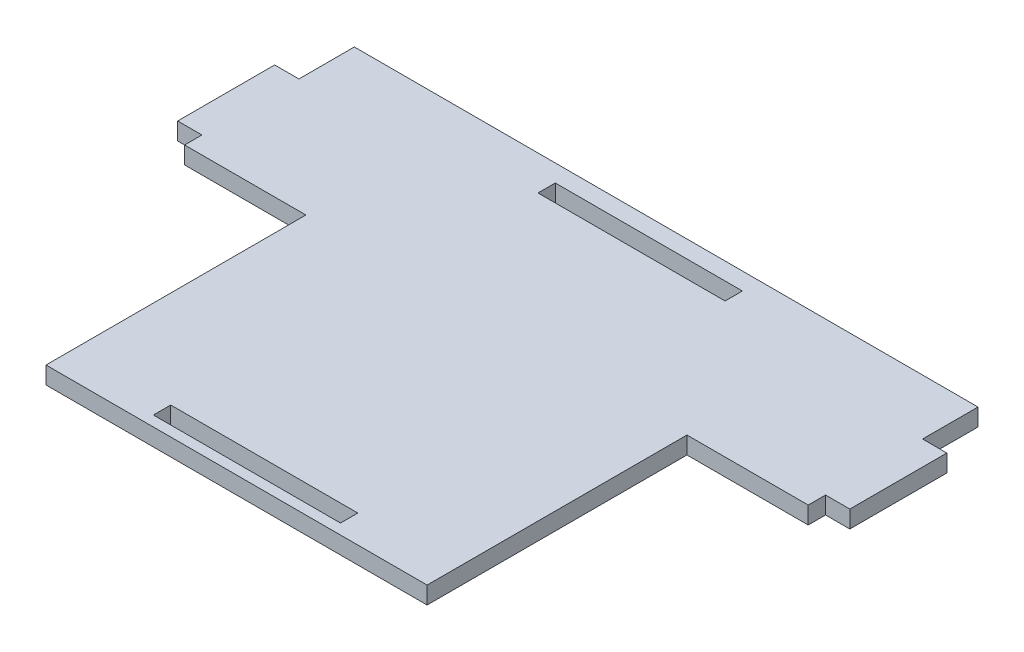
ISO-10303-21;
HEADER;
FILE_DESCRIPTION(('STEP AP214'),'2;1');
FILE_NAME('part.step','',(''),(''),'','','');
FILE_SCHEMA(('AUTOMOTIVE_DESIGN { 1 0 10303 214 1 1 1 1 }'));
ENDSEC;
DATA;
#1=APPLICATION_CONTEXT('core data for automotive mechanical design processes');
#2=APPLICATION_PROTOCOL_DEFINITION('international standard','automotive_design',2000,#1);
#3=PRODUCT_CONTEXT('',#1,'mechanical');
#4=PRODUCT('Part','Part','',(#3));
#5=PRODUCT_RELATED_PRODUCT_CATEGORY('part','',(#4));
#6=PRODUCT_DEFINITION_FORMATION('','',#4);
#7=PRODUCT_DEFINITION_CONTEXT('part definition',#1,'design');
#8=PRODUCT_DEFINITION('design','',#6,#7);
#9=PRODUCT_DEFINITION_SHAPE('','',#8);
#10=(LENGTH_UNIT() NAMED_UNIT(*) SI_UNIT(.MILLI.,.METRE.));
#11=(NAMED_UNIT(*) PLANE_ANGLE_UNIT() SI_UNIT($,.RADIAN.));
#12=(NAMED_UNIT(*) SI_UNIT($,.STERADIAN.) SOLID_ANGLE_UNIT());
#13=UNCERTAINTY_MEASURE_WITH_UNIT(LENGTH_MEASURE(1.E-05),#10,'distance_accuracy_value','');
#14=(GEOMETRIC_REPRESENTATION_CONTEXT(3) GLOBAL_UNCERTAINTY_ASSIGNED_CONTEXT((#13)) GLOBAL_UNIT_ASSIGNED_CONTEXT((#10,
#11,#12)) REPRESENTATION_CONTEXT('',''));
#15=CARTESIAN_POINT('',(0.,0.,0.));
#16=DIRECTION('',(0.,0.,1.));
#17=DIRECTION('',(1.,0.,0.));
#18=AXIS2_PLACEMENT_3D('',#15,#16,#17);
#19=CARTESIAN_POINT('',(0.,5.,0.));
#20=DIRECTION('',(0.,-1.,0.));
#21=DIRECTION('',(0.,0.,-1.));
#22=AXIS2_PLACEMENT_3D('',#19,#20,#21);
#23=PLANE('',#22);
#24=DIRECTION('',(-1.,0.,0.));
#25=VECTOR('',#24,1.);
#26=CARTESIAN_POINT('',(-27.,5.,53.));
#27=LINE('',#26,#25);
#28=CARTESIAN_POINT('',(27.,5.,53.));
#29=VERTEX_POINT('',#28);
#30=CARTESIAN_POINT('',(-27.,5.,53.));
#31=VERTEX_POINT('',#30);
#32=EDGE_CURVE('E249',#29,#31,#27,.T.);
#33=ORIENTED_EDGE('',*,*,#32,.F.);
#34=DIRECTION('',(0.,0.,-1.));
#35=VECTOR('',#34,1.);
#36=CARTESIAN_POINT('',(27.,5.,58.));
#37=LINE('',#36,#35);
#38=CARTESIAN_POINT('',(27.,5.,58.));
#39=VERTEX_POINT('',#38);
#40=EDGE_CURVE('E260',#39,#29,#37,.T.);
#41=ORIENTED_EDGE('',*,*,#40,.F.);
#42=DIRECTION('',(1.,0.,0.));
#43=VECTOR('',#42,1.);
#44=CARTESIAN_POINT('',(-27.,5.,58.));
#45=LINE('',#44,#43);
#46=CARTESIAN_POINT('',(-27.,5.,58.));
#47=VERTEX_POINT('',#46);
#48=EDGE_CURVE('E256',#47,#39,#45,.T.);
#49=ORIENTED_EDGE('',*,*,#48,.F.);
#50=DIRECTION('',(0.,0.,1.));
#51=VECTOR('',#50,1.);
#52=CARTESIAN_POINT('',(-27.,5.,58.));
#53=LINE('',#52,#51);
#54=EDGE_CURVE('E252',#31,#47,#53,.T.);
#55=ORIENTED_EDGE('',*,*,#54,.F.);
#56=EDGE_LOOP('',(#33,#41,#49,#55));
#57=FACE_BOUND('',#56,.T.);
#58=DIRECTION('',(0.,0.,-1.));
#59=VECTOR('',#58,1.);
#60=CARTESIAN_POINT('',(90.,5.,-47.));
#61=LINE('',#60,#59);
#62=CARTESIAN_POINT('',(90.,5.,-47.));
#63=VERTEX_POINT('',#62);
#64=CARTESIAN_POINT('',(90.,5.,-63.));
#65=VERTEX_POINT('',#64);
#66=EDGE_CURVE('E292',#63,#65,#61,.T.);
#67=ORIENTED_EDGE('',*,*,#66,.T.);
#68=DIRECTION('',(-1.,0.,0.));
#69=VECTOR('',#68,1.);
#70=CARTESIAN_POINT('',(-90.,5.,-63.));
#71=LINE('',#70,#69);
#72=CARTESIAN_POINT('',(-90.,5.,-63.));
#73=VERTEX_POINT('',#72);
#74=EDGE_CURVE('E296',#65,#73,#71,.T.);
#75=ORIENTED_EDGE('',*,*,#74,.T.);
#76=DIRECTION('',(0.,0.,1.));
#77=VECTOR('',#76,1.);
#78=CARTESIAN_POINT('',(-90.0000000000001,5.,-47.));
#79=LINE('',#78,#77);
#80=CARTESIAN_POINT('',(-90.0000000000001,5.,-47.));
#81=VERTEX_POINT('',#80);
#82=EDGE_CURVE('E300',#73,#81,#79,.T.);
#83=ORIENTED_EDGE('',*,*,#82,.T.);
#84=DIRECTION('',(-1.,0.,0.));
#85=VECTOR('',#84,1.);
#86=CARTESIAN_POINT('',(-90.0000000000001,5.,-47.));
#87=LINE('',#86,#85);
#88=CARTESIAN_POINT('',(-97.,5.,-47.));
#89=VERTEX_POINT('',#88);
#90=EDGE_CURVE('E303',#81,#89,#87,.T.);
#91=ORIENTED_EDGE('',*,*,#90,.T.);
#92=DIRECTION('',(0.,0.,1.));
#93=VECTOR('',#92,1.);
#94=CARTESIAN_POINT('',(-97.,5.,-47.));
#95=LINE('',#94,#93);
#96=CARTESIAN_POINT('',(-97.,5.,-19.));
#97=VERTEX_POINT('',#96);
#98=EDGE_CURVE('E306',#89,#97,#95,.T.);
#99=ORIENTED_EDGE('',*,*,#98,.T.);
#100=DIRECTION('',(1.,0.,0.));
#101=VECTOR('',#100,1.);
#102=CARTESIAN_POINT('',(-97.,5.,-19.));
#103=LINE('',#102,#101);
#104=CARTESIAN_POINT('',(-90.0000000000001,5.,-19.));
#105=VERTEX_POINT('',#104);
#106=EDGE_CURVE('E309',#97,#105,#103,.T.);
#107=ORIENTED_EDGE('',*,*,#106,.T.);
#108=DIRECTION('',(0.,0.,1.));
#109=VECTOR('',#108,1.);
#110=CARTESIAN_POINT('',(-90.,5.,-14.));
#111=LINE('',#110,#109);
#112=CARTESIAN_POINT('',(-90.,5.,-14.));
#113=VERTEX_POINT('',#112);
#114=EDGE_CURVE('E312',#105,#113,#111,.T.);
#115=ORIENTED_EDGE('',*,*,#114,.T.);
#116=DIRECTION('',(1.,0.,0.));
#117=VECTOR('',#116,1.);
#118=CARTESIAN_POINT('',(-90.,5.,-14.));
#119=LINE('',#118,#117);
#120=CARTESIAN_POINT('',(-55.,5.,-14.));
#121=VERTEX_POINT('',#120);
#122=EDGE_CURVE('E315',#113,#121,#119,.T.);
#123=ORIENTED_EDGE('',*,*,#122,.T.);
#124=DIRECTION('',(0.,0.,1.));
#125=VECTOR('',#124,1.);
#126=CARTESIAN_POINT('',(-55.,5.,-14.));
#127=LINE('',#126,#125);
#128=CARTESIAN_POINT('',(-55.,5.,61.));
#129=VERTEX_POINT('',#128);
#130=EDGE_CURVE('E318',#121,#129,#127,.T.);
#131=ORIENTED_EDGE('',*,*,#130,.T.);
#132=DIRECTION('',(1.,0.,0.));
#133=VECTOR('',#132,1.);
#134=CARTESIAN_POINT('',(-55.,5.,61.));
#135=LINE('',#134,#133);
#136=CARTESIAN_POINT('',(55.,5.,61.));
#137=VERTEX_POINT('',#136);
#138=EDGE_CURVE('E321',#129,#137,#135,.T.);
#139=ORIENTED_EDGE('',*,*,#138,.T.);
#140=DIRECTION('',(0.,0.,-1.));
#141=VECTOR('',#140,1.);
#142=CARTESIAN_POINT('',(55.,5.,-14.));
#143=LINE('',#142,#141);
#144=CARTESIAN_POINT('',(55.,5.,-14.));
#145=VERTEX_POINT('',#144);
#146=EDGE_CURVE('E324',#137,#145,#143,.T.);
#147=ORIENTED_EDGE('',*,*,#146,.T.);
#148=DIRECTION('',(1.,0.,0.));
#149=VECTOR('',#148,1.);
#150=CARTESIAN_POINT('',(90.,5.,-14.));
#151=LINE('',#150,#149);
#152=CARTESIAN_POINT('',(90.,5.,-14.));
#153=VERTEX_POINT('',#152);
#154=EDGE_CURVE('E327',#145,#153,#151,.T.);
#155=ORIENTED_EDGE('',*,*,#154,.T.);
#156=DIRECTION('',(0.,0.,-1.));
#157=VECTOR('',#156,1.);
#158=CARTESIAN_POINT('',(90.,5.,-14.));
#159=LINE('',#158,#157);
#160=CARTESIAN_POINT('',(90.,5.,-19.));
#161=VERTEX_POINT('',#160);
#162=EDGE_CURVE('E330',#153,#161,#159,.T.);
#163=ORIENTED_EDGE('',*,*,#162,.T.);
#164=DIRECTION('',(1.,0.,0.));
#165=VECTOR('',#164,1.);
#166=CARTESIAN_POINT('',(96.9999999999999,5.,-19.));
#167=LINE('',#166,#165);
#168=CARTESIAN_POINT('',(96.9999999999999,5.,-19.));
#169=VERTEX_POINT('',#168);
#170=EDGE_CURVE('E333',#161,#169,#167,.T.);
#171=ORIENTED_EDGE('',*,*,#170,.T.);
#172=DIRECTION('',(0.,0.,-1.));
#173=VECTOR('',#172,1.);
#174=CARTESIAN_POINT('',(96.9999999999999,5.,-47.));
#175=LINE('',#174,#173);
#176=CARTESIAN_POINT('',(96.9999999999999,5.,-47.));
#177=VERTEX_POINT('',#176);
#178=EDGE_CURVE('E336',#169,#177,#175,.T.);
#179=ORIENTED_EDGE('',*,*,#178,.T.);
#180=DIRECTION('',(-1.,0.,0.));
#181=VECTOR('',#180,1.);
#182=CARTESIAN_POINT('',(90.,5.,-47.));
#183=LINE('',#182,#181);
#184=EDGE_CURVE('E339',#177,#63,#183,.T.);
#185=ORIENTED_EDGE('',*,*,#184,.T.);
#186=EDGE_LOOP('',(#67,#75,#83,#91,#99,#107,#115,#123,#131,#139,#147,#155,#163,#171,#179,#185));
#187=FACE_BOUND('',#186,.T.);
#188=DIRECTION('',(0.,0.,-1.));
#189=VECTOR('',#188,1.);
#190=CARTESIAN_POINT('',(27.,5.,-53.));
#191=LINE('',#190,#189);
#192=CARTESIAN_POINT('',(27.,5.,-53.));
#193=VERTEX_POINT('',#192);
#194=CARTESIAN_POINT('',(27.,5.,-58.));
#195=VERTEX_POINT('',#194);
#196=EDGE_CURVE('E201',#193,#195,#191,.T.);
#197=ORIENTED_EDGE('',*,*,#196,.F.);
#198=DIRECTION('',(1.,0.,0.));
#199=VECTOR('',#198,1.);
#200=CARTESIAN_POINT('',(-27.,5.,-53.));
#201=LINE('',#200,#199);
#202=CARTESIAN_POINT('',(-27.,5.,-53.));
#203=VERTEX_POINT('',#202);
#204=EDGE_CURVE('E227',#203,#193,#201,.T.);
#205=ORIENTED_EDGE('',*,*,#204,.F.);
#206=DIRECTION('',(0.,0.,1.));
#207=VECTOR('',#206,1.);
#208=CARTESIAN_POINT('',(-27.,5.,-53.));
#209=LINE('',#208,#207);
#210=CARTESIAN_POINT('',(-27.,5.,-58.));
#211=VERTEX_POINT('',#210);
#212=EDGE_CURVE('E223',#211,#203,#209,.T.);
#213=ORIENTED_EDGE('',*,*,#212,.F.);
#214=DIRECTION('',(-1.,0.,0.));
#215=VECTOR('',#214,1.);
#216=CARTESIAN_POINT('',(-27.,5.,-58.));
#217=LINE('',#216,#215);
#218=EDGE_CURVE('E210',#195,#211,#217,.T.);
#219=ORIENTED_EDGE('',*,*,#218,.F.);
#220=EDGE_LOOP('',(#197,#205,#213,#219));
#221=FACE_BOUND('',#220,.T.);
#222=ADVANCED_FACE('F39',(#57,#187,#221),#23,.F.);
#223=CARTESIAN_POINT('',(0.,0.,0.));
#224=DIRECTION('',(0.,-1.,0.));
#225=DIRECTION('',(0.,0.,-1.));
#226=AXIS2_PLACEMENT_3D('',#223,#224,#225);
#227=PLANE('',#226);
#228=DIRECTION('',(0.,0.,-1.));
#229=VECTOR('',#228,1.);
#230=CARTESIAN_POINT('',(90.,0.,-47.));
#231=LINE('',#230,#229);
#232=CARTESIAN_POINT('',(90.,0.,-47.));
#233=VERTEX_POINT('',#232);
#234=CARTESIAN_POINT('',(90.,0.,-63.));
#235=VERTEX_POINT('',#234);
#236=EDGE_CURVE('E291',#233,#235,#231,.T.);
#237=ORIENTED_EDGE('',*,*,#236,.F.);
#238=DIRECTION('',(-1.,0.,0.));
#239=VECTOR('',#238,1.);
#240=CARTESIAN_POINT('',(90.,0.,-47.));
#241=LINE('',#240,#239);
#242=CARTESIAN_POINT('',(96.9999999999999,0.,-47.));
#243=VERTEX_POINT('',#242);
#244=EDGE_CURVE('E297',#243,#233,#241,.T.);
#245=ORIENTED_EDGE('',*,*,#244,.F.);
#246=DIRECTION('',(0.,0.,-1.));
#247=VECTOR('',#246,1.);
#248=CARTESIAN_POINT('',(96.9999999999999,0.,-47.));
#249=LINE('',#248,#247);
#250=CARTESIAN_POINT('',(96.9999999999999,0.,-19.));
#251=VERTEX_POINT('',#250);
#252=EDGE_CURVE('E385',#251,#243,#249,.T.);
#253=ORIENTED_EDGE('',*,*,#252,.F.);
#254=DIRECTION('',(1.,0.,0.));
#255=VECTOR('',#254,1.);
#256=CARTESIAN_POINT('',(96.9999999999999,0.,-19.));
#257=LINE('',#256,#255);
#258=CARTESIAN_POINT('',(90.,0.,-19.));
#259=VERTEX_POINT('',#258);
#260=EDGE_CURVE('E382',#259,#251,#257,.T.);
#261=ORIENTED_EDGE('',*,*,#260,.F.);
#262=DIRECTION('',(0.,0.,-1.));
#263=VECTOR('',#262,1.);
#264=CARTESIAN_POINT('',(90.,0.,-14.));
#265=LINE('',#264,#263);
#266=CARTESIAN_POINT('',(90.,0.,-14.));
#267=VERTEX_POINT('',#266);
#268=EDGE_CURVE('E379',#267,#259,#265,.T.);
#269=ORIENTED_EDGE('',*,*,#268,.F.);
#270=DIRECTION('',(1.,0.,0.));
#271=VECTOR('',#270,1.);
#272=CARTESIAN_POINT('',(90.,0.,-14.));
#273=LINE('',#272,#271);
#274=CARTESIAN_POINT('',(55.,0.,-14.));
#275=VERTEX_POINT('',#274);
#276=EDGE_CURVE('E376',#275,#267,#273,.T.);
#277=ORIENTED_EDGE('',*,*,#276,.F.);
#278=DIRECTION('',(0.,0.,-1.));
#279=VECTOR('',#278,1.);
#280=CARTESIAN_POINT('',(55.,0.,-14.));
#281=LINE('',#280,#279);
#282=CARTESIAN_POINT('',(55.,0.,61.));
#283=VERTEX_POINT('',#282);
#284=EDGE_CURVE('E373',#283,#275,#281,.T.);
#285=ORIENTED_EDGE('',*,*,#284,.F.);
#286=DIRECTION('',(1.,0.,0.));
#287=VECTOR('',#286,1.);
#288=CARTESIAN_POINT('',(-55.,0.,61.));
#289=LINE('',#288,#287);
#290=CARTESIAN_POINT('',(-55.,0.,61.));
#291=VERTEX_POINT('',#290);
#292=EDGE_CURVE('E370',#291,#283,#289,.T.);
#293=ORIENTED_EDGE('',*,*,#292,.F.);
#294=DIRECTION('',(0.,0.,1.));
#295=VECTOR('',#294,1.);
#296=CARTESIAN_POINT('',(-55.,0.,-14.));
#297=LINE('',#296,#295);
#298=CARTESIAN_POINT('',(-55.,0.,-14.));
#299=VERTEX_POINT('',#298);
#300=EDGE_CURVE('E367',#299,#291,#297,.T.);
#301=ORIENTED_EDGE('',*,*,#300,.F.);
#302=DIRECTION('',(1.,0.,0.));
#303=VECTOR('',#302,1.);
#304=CARTESIAN_POINT('',(-90.,0.,-14.));
#305=LINE('',#304,#303);
#306=CARTESIAN_POINT('',(-90.,0.,-14.));
#307=VERTEX_POINT('',#306);
#308=EDGE_CURVE('E364',#307,#299,#305,.T.);
#309=ORIENTED_EDGE('',*,*,#308,.F.);
#310=DIRECTION('',(0.,0.,1.));
#311=VECTOR('',#310,1.);
#312=CARTESIAN_POINT('',(-90.,0.,-14.));
#313=LINE('',#312,#311);
#314=CARTESIAN_POINT('',(-90.0000000000001,0.,-19.));
#315=VERTEX_POINT('',#314);
#316=EDGE_CURVE('E361',#315,#307,#313,.T.);
#317=ORIENTED_EDGE('',*,*,#316,.F.);
#318=DIRECTION('',(1.,0.,0.));
#319=VECTOR('',#318,1.);
#320=CARTESIAN_POINT('',(-97.,0.,-19.));
#321=LINE('',#320,#319);
#322=CARTESIAN_POINT('',(-97.,0.,-19.));
#323=VERTEX_POINT('',#322);
#324=EDGE_CURVE('E358',#323,#315,#321,.T.);
#325=ORIENTED_EDGE('',*,*,#324,.F.);
#326=DIRECTION('',(0.,0.,1.));
#327=VECTOR('',#326,1.);
#328=CARTESIAN_POINT('',(-97.,0.,-47.));
#329=LINE('',#328,#327);
#330=CARTESIAN_POINT('',(-97.,0.,-47.));
#331=VERTEX_POINT('',#330);
#332=EDGE_CURVE('E355',#331,#323,#329,.T.);
#333=ORIENTED_EDGE('',*,*,#332,.F.);
#334=DIRECTION('',(-1.,0.,0.));
#335=VECTOR('',#334,1.);
#336=CARTESIAN_POINT('',(-90.0000000000001,0.,-47.));
#337=LINE('',#336,#335);
#338=CARTESIAN_POINT('',(-90.0000000000001,0.,-47.));
#339=VERTEX_POINT('',#338);
#340=EDGE_CURVE('E352',#339,#331,#337,.T.);
#341=ORIENTED_EDGE('',*,*,#340,.F.);
#342=DIRECTION('',(0.,0.,1.));
#343=VECTOR('',#342,1.);
#344=CARTESIAN_POINT('',(-90.0000000000001,0.,-47.));
#345=LINE('',#344,#343);
#346=CARTESIAN_POINT('',(-90.,0.,-63.));
#347=VERTEX_POINT('',#346);
#348=EDGE_CURVE('E349',#347,#339,#345,.T.);
#349=ORIENTED_EDGE('',*,*,#348,.F.);
#350=DIRECTION('',(-1.,0.,0.));
#351=VECTOR('',#350,1.);
#352=CARTESIAN_POINT('',(-90.,0.,-63.));
#353=LINE('',#352,#351);
#354=EDGE_CURVE('E346',#235,#347,#353,.T.);
#355=ORIENTED_EDGE('',*,*,#354,.F.);
#356=EDGE_LOOP('',(#237,#245,#253,#261,#269,#277,#285,#293,#301,#309,#317,#325,#333,#341,#349,#355));
#357=FACE_BOUND('',#356,.T.);
#358=DIRECTION('',(0.,0.,-1.));
#359=VECTOR('',#358,1.);
#360=CARTESIAN_POINT('',(27.,0.,58.));
#361=LINE('',#360,#359);
#362=CARTESIAN_POINT('',(27.,0.,58.));
#363=VERTEX_POINT('',#362);
#364=CARTESIAN_POINT('',(27.,0.,53.));
#365=VERTEX_POINT('',#364);
#366=EDGE_CURVE('E253',#363,#365,#361,.T.);
#367=ORIENTED_EDGE('',*,*,#366,.T.);
#368=DIRECTION('',(-1.,0.,0.));
#369=VECTOR('',#368,1.);
#370=CARTESIAN_POINT('',(-27.,0.,53.));
#371=LINE('',#370,#369);
#372=CARTESIAN_POINT('',(-27.,0.,53.));
#373=VERTEX_POINT('',#372);
#374=EDGE_CURVE('E219',#365,#373,#371,.T.);
#375=ORIENTED_EDGE('',*,*,#374,.T.);
#376=DIRECTION('',(0.,0.,1.));
#377=VECTOR('',#376,1.);
#378=CARTESIAN_POINT('',(-27.,0.,58.));
#379=LINE('',#378,#377);
#380=CARTESIAN_POINT('',(-27.,0.,58.));
#381=VERTEX_POINT('',#380);
#382=EDGE_CURVE('E267',#373,#381,#379,.T.);
#383=ORIENTED_EDGE('',*,*,#382,.T.);
#384=DIRECTION('',(1.,0.,0.));
#385=VECTOR('',#384,1.);
#386=CARTESIAN_POINT('',(-27.,0.,58.));
#387=LINE('',#386,#385);
#388=EDGE_CURVE('E271',#381,#363,#387,.T.);
#389=ORIENTED_EDGE('',*,*,#388,.T.);
#390=EDGE_LOOP('',(#367,#375,#383,#389));
#391=FACE_BOUND('',#390,.T.);
#392=DIRECTION('',(1.,0.,0.));
#393=VECTOR('',#392,1.);
#394=CARTESIAN_POINT('',(-27.,0.,-53.));
#395=LINE('',#394,#393);
#396=CARTESIAN_POINT('',(-27.,0.,-53.));
#397=VERTEX_POINT('',#396);
#398=CARTESIAN_POINT('',(27.,0.,-53.));
#399=VERTEX_POINT('',#398);
#400=EDGE_CURVE('E211',#397,#399,#395,.T.);
#401=ORIENTED_EDGE('',*,*,#400,.T.);
#402=DIRECTION('',(0.,0.,-1.));
#403=VECTOR('',#402,1.);
#404=CARTESIAN_POINT('',(27.,0.,-53.));
#405=LINE('',#404,#403);
#406=CARTESIAN_POINT('',(27.,0.,-58.));
#407=VERTEX_POINT('',#406);
#408=EDGE_CURVE('E63',#399,#407,#405,.T.);
#409=ORIENTED_EDGE('',*,*,#408,.T.);
#410=DIRECTION('',(-1.,0.,0.));
#411=VECTOR('',#410,1.);
#412=CARTESIAN_POINT('',(-27.,0.,-58.));
#413=LINE('',#412,#411);
#414=CARTESIAN_POINT('',(-27.,0.,-58.));
#415=VERTEX_POINT('',#414);
#416=EDGE_CURVE('E217',#407,#415,#413,.T.);
#417=ORIENTED_EDGE('',*,*,#416,.T.);
#418=DIRECTION('',(0.,0.,1.));
#419=VECTOR('',#418,1.);
#420=CARTESIAN_POINT('',(-27.,0.,-53.));
#421=LINE('',#420,#419);
#422=EDGE_CURVE('E236',#415,#397,#421,.T.);
#423=ORIENTED_EDGE('',*,*,#422,.T.);
#424=EDGE_LOOP('',(#401,#409,#417,#423));
#425=FACE_BOUND('',#424,.T.);
#426=ADVANCED_FACE('F456',(#357,#391,#425),#227,.T.);
#427=CARTESIAN_POINT('',(90.,5.,-47.));
#428=DIRECTION('',(-1.,0.,0.));
#429=DIRECTION('',(0.,0.,1.));
#430=AXIS2_PLACEMENT_3D('',#427,#428,#429);
#431=PLANE('',#430);
#432=ORIENTED_EDGE('',*,*,#236,.T.);
#433=DIRECTION('',(0.,-1.,0.));
#434=VECTOR('',#433,1.);
#435=CARTESIAN_POINT('',(90.,5.,-63.));
#436=LINE('',#435,#434);
#437=EDGE_CURVE('E11',#65,#235,#436,.T.);
#438=ORIENTED_EDGE('',*,*,#437,.F.);
#439=ORIENTED_EDGE('',*,*,#66,.F.);
#440=DIRECTION('',(0.,-1.,0.));
#441=VECTOR('',#440,1.);
#442=CARTESIAN_POINT('',(90.,5.,-47.));
#443=LINE('',#442,#441);
#444=EDGE_CURVE('E342',#63,#233,#443,.T.);
#445=ORIENTED_EDGE('',*,*,#444,.T.);
#446=EDGE_LOOP('',(#432,#438,#439,#445));
#447=FACE_BOUND('',#446,.T.);
#448=ADVANCED_FACE('F41',(#447),#431,.F.);
#449=CARTESIAN_POINT('',(-90.,5.,-63.));
#450=DIRECTION('',(0.,0.,1.));
#451=DIRECTION('',(1.,0.,0.));
#452=AXIS2_PLACEMENT_3D('',#449,#450,#451);
#453=PLANE('',#452);
#454=ORIENTED_EDGE('',*,*,#354,.T.);
#455=DIRECTION('',(0.,-1.,0.));
#456=VECTOR('',#455,1.);
#457=CARTESIAN_POINT('',(-90.,5.,-63.));
#458=LINE('',#457,#456);
#459=EDGE_CURVE('E48',#73,#347,#458,.T.);
#460=ORIENTED_EDGE('',*,*,#459,.F.);
#461=ORIENTED_EDGE('',*,*,#74,.F.);
#462=ORIENTED_EDGE('',*,*,#437,.T.);
#463=EDGE_LOOP('',(#454,#460,#461,#462));
#464=FACE_BOUND('',#463,.T.);
#465=ADVANCED_FACE('F473',(#464),#453,.F.);
#466=CARTESIAN_POINT('',(-90.0000000000001,5.,-47.));
#467=DIRECTION('',(1.,0.,0.));
#468=DIRECTION('',(0.,0.,-1.));
#469=AXIS2_PLACEMENT_3D('',#466,#467,#468);
#470=PLANE('',#469);
#471=ORIENTED_EDGE('',*,*,#348,.T.);
#472=DIRECTION('',(0.,-1.,0.));
#473=VECTOR('',#472,1.);
#474=CARTESIAN_POINT('',(-90.0000000000001,5.,-47.));
#475=LINE('',#474,#473);
#476=EDGE_CURVE('E441',#81,#339,#475,.T.);
#477=ORIENTED_EDGE('',*,*,#476,.F.);
#478=ORIENTED_EDGE('',*,*,#82,.F.);
#479=ORIENTED_EDGE('',*,*,#459,.T.);
#480=EDGE_LOOP('',(#471,#477,#478,#479));
#481=FACE_BOUND('',#480,.T.);
#482=ADVANCED_FACE('F450',(#481),#470,.F.);
#483=CARTESIAN_POINT('',(-90.0000000000001,5.,-47.));
#484=DIRECTION('',(0.,0.,1.));
#485=DIRECTION('',(1.,0.,0.));
#486=AXIS2_PLACEMENT_3D('',#483,#484,#485);
#487=PLANE('',#486);
#488=ORIENTED_EDGE('',*,*,#340,.T.);
#489=DIRECTION('',(0.,-1.,0.));
#490=VECTOR('',#489,1.);
#491=CARTESIAN_POINT('',(-97.,5.,-47.));
#492=LINE('',#491,#490);
#493=EDGE_CURVE('E437',#89,#331,#492,.T.);
#494=ORIENTED_EDGE('',*,*,#493,.F.);
#495=ORIENTED_EDGE('',*,*,#90,.F.);
#496=ORIENTED_EDGE('',*,*,#476,.T.);
#497=EDGE_LOOP('',(#488,#494,#495,#496));
#498=FACE_BOUND('',#497,.T.);
#499=ADVANCED_FACE('F462',(#498),#487,.F.);
#500=CARTESIAN_POINT('',(-97.,5.,-47.));
#501=DIRECTION('',(1.,0.,0.));
#502=DIRECTION('',(0.,0.,-1.));
#503=AXIS2_PLACEMENT_3D('',#500,#501,#502);
#504=PLANE('',#503);
#505=ORIENTED_EDGE('',*,*,#332,.T.);
#506=DIRECTION('',(0.,-1.,0.));
#507=VECTOR('',#506,1.);
#508=CARTESIAN_POINT('',(-97.,5.,-19.));
#509=LINE('',#508,#507);
#510=EDGE_CURVE('E433',#97,#323,#509,.T.);
#511=ORIENTED_EDGE('',*,*,#510,.F.);
#512=ORIENTED_EDGE('',*,*,#98,.F.);
#513=ORIENTED_EDGE('',*,*,#493,.T.);
#514=EDGE_LOOP('',(#505,#511,#512,#513));
#515=FACE_BOUND('',#514,.T.);
#516=ADVANCED_FACE('F466',(#515),#504,.F.);
#517=CARTESIAN_POINT('',(-97.,5.,-19.));
#518=DIRECTION('',(0.,0.,-1.));
#519=DIRECTION('',(-1.,0.,0.));
#520=AXIS2_PLACEMENT_3D('',#517,#518,#519);
#521=PLANE('',#520);
#522=ORIENTED_EDGE('',*,*,#324,.T.);
#523=DIRECTION('',(0.,-1.,0.));
#524=VECTOR('',#523,1.);
#525=CARTESIAN_POINT('',(-90.0000000000001,5.,-19.));
#526=LINE('',#525,#524);
#527=EDGE_CURVE('E429',#105,#315,#526,.T.);
#528=ORIENTED_EDGE('',*,*,#527,.F.);
#529=ORIENTED_EDGE('',*,*,#106,.F.);
#530=ORIENTED_EDGE('',*,*,#510,.T.);
#531=EDGE_LOOP('',(#522,#528,#529,#530));
#532=FACE_BOUND('',#531,.T.);
#533=ADVANCED_FACE('F526',(#532),#521,.F.);
#534=CARTESIAN_POINT('',(-90.,5.,-14.));
#535=DIRECTION('',(1.,0.,0.));
#536=DIRECTION('',(0.,0.,-1.));
#537=AXIS2_PLACEMENT_3D('',#534,#535,#536);
#538=PLANE('',#537);
#539=ORIENTED_EDGE('',*,*,#316,.T.);
#540=DIRECTION('',(0.,-1.,0.));
#541=VECTOR('',#540,1.);
#542=CARTESIAN_POINT('',(-90.,5.,-14.));
#543=LINE('',#542,#541);
#544=EDGE_CURVE('E425',#113,#307,#543,.T.);
#545=ORIENTED_EDGE('',*,*,#544,.F.);
#546=ORIENTED_EDGE('',*,*,#114,.F.);
#547=ORIENTED_EDGE('',*,*,#527,.T.);
#548=EDGE_LOOP('',(#539,#545,#546,#547));
#549=FACE_BOUND('',#548,.T.);
#550=ADVANCED_FACE('F523',(#549),#538,.F.);
#551=CARTESIAN_POINT('',(-90.,5.,-14.));
#552=DIRECTION('',(0.,0.,-1.));
#553=DIRECTION('',(-1.,0.,0.));
#554=AXIS2_PLACEMENT_3D('',#551,#552,#553);
#555=PLANE('',#554);
#556=ORIENTED_EDGE('',*,*,#308,.T.);
#557=DIRECTION('',(0.,-1.,0.));
#558=VECTOR('',#557,1.);
#559=CARTESIAN_POINT('',(-55.,5.,-14.));
#560=LINE('',#559,#558);
#561=EDGE_CURVE('E421',#121,#299,#560,.T.);
#562=ORIENTED_EDGE('',*,*,#561,.F.);
#563=ORIENTED_EDGE('',*,*,#122,.F.);
#564=ORIENTED_EDGE('',*,*,#544,.T.);
#565=EDGE_LOOP('',(#556,#562,#563,#564));
#566=FACE_BOUND('',#565,.T.);
#567=ADVANCED_FACE('F519',(#566),#555,.F.);
#568=CARTESIAN_POINT('',(-55.,5.,-14.));
#569=DIRECTION('',(1.,0.,0.));
#570=DIRECTION('',(0.,0.,-1.));
#571=AXIS2_PLACEMENT_3D('',#568,#569,#570);
#572=PLANE('',#571);
#573=ORIENTED_EDGE('',*,*,#300,.T.);
#574=DIRECTION('',(0.,-1.,0.));
#575=VECTOR('',#574,1.);
#576=CARTESIAN_POINT('',(-55.,5.,61.));
#577=LINE('',#576,#575);
#578=EDGE_CURVE('E417',#129,#291,#577,.T.);
#579=ORIENTED_EDGE('',*,*,#578,.F.);
#580=ORIENTED_EDGE('',*,*,#130,.F.);
#581=ORIENTED_EDGE('',*,*,#561,.T.);
#582=EDGE_LOOP('',(#573,#579,#580,#581));
#583=FACE_BOUND('',#582,.T.);
#584=ADVANCED_FACE('F515',(#583),#572,.F.);
#585=CARTESIAN_POINT('',(-55.,5.,61.));
#586=DIRECTION('',(0.,0.,-1.));
#587=DIRECTION('',(-1.,0.,0.));
#588=AXIS2_PLACEMENT_3D('',#585,#586,#587);
#589=PLANE('',#588);
#590=ORIENTED_EDGE('',*,*,#292,.T.);
#591=DIRECTION('',(0.,-1.,0.));
#592=VECTOR('',#591,1.);
#593=CARTESIAN_POINT('',(55.,5.,61.));
#594=LINE('',#593,#592);
#595=EDGE_CURVE('E413',#137,#283,#594,.T.);
#596=ORIENTED_EDGE('',*,*,#595,.F.);
#597=ORIENTED_EDGE('',*,*,#138,.F.);
#598=ORIENTED_EDGE('',*,*,#578,.T.);
#599=EDGE_LOOP('',(#590,#596,#597,#598));
#600=FACE_BOUND('',#599,.T.);
#601=ADVANCED_FACE('F510',(#600),#589,.F.);
#602=CARTESIAN_POINT('',(55.,5.,-14.));
#603=DIRECTION('',(-1.,0.,0.));
#604=DIRECTION('',(0.,0.,1.));
#605=AXIS2_PLACEMENT_3D('',#602,#603,#604);
#606=PLANE('',#605);
#607=ORIENTED_EDGE('',*,*,#284,.T.);
#608=DIRECTION('',(0.,-1.,0.));
#609=VECTOR('',#608,1.);
#610=CARTESIAN_POINT('',(55.,5.,-14.));
#611=LINE('',#610,#609);
#612=EDGE_CURVE('E409',#145,#275,#611,.T.);
#613=ORIENTED_EDGE('',*,*,#612,.F.);
#614=ORIENTED_EDGE('',*,*,#146,.F.);
#615=ORIENTED_EDGE('',*,*,#595,.T.);
#616=EDGE_LOOP('',(#607,#613,#614,#615));
#617=FACE_BOUND('',#616,.T.);
#618=ADVANCED_FACE('F504',(#617),#606,.F.);
#619=CARTESIAN_POINT('',(90.,5.,-14.));
#620=DIRECTION('',(0.,0.,-1.));
#621=DIRECTION('',(-1.,0.,0.));
#622=AXIS2_PLACEMENT_3D('',#619,#620,#621);
#623=PLANE('',#622);
#624=ORIENTED_EDGE('',*,*,#276,.T.);
#625=DIRECTION('',(0.,-1.,0.));
#626=VECTOR('',#625,1.);
#627=CARTESIAN_POINT('',(90.,5.,-14.));
#628=LINE('',#627,#626);
#629=EDGE_CURVE('E405',#153,#267,#628,.T.);
#630=ORIENTED_EDGE('',*,*,#629,.F.);
#631=ORIENTED_EDGE('',*,*,#154,.F.);
#632=ORIENTED_EDGE('',*,*,#612,.T.);
#633=EDGE_LOOP('',(#624,#630,#631,#632));
#634=FACE_BOUND('',#633,.T.);
#635=ADVANCED_FACE('F500',(#634),#623,.F.);
#636=CARTESIAN_POINT('',(90.,5.,-14.));
#637=DIRECTION('',(-1.,0.,0.));
#638=DIRECTION('',(0.,0.,1.));
#639=AXIS2_PLACEMENT_3D('',#636,#637,#638);
#640=PLANE('',#639);
#641=ORIENTED_EDGE('',*,*,#268,.T.);
#642=DIRECTION('',(0.,-1.,0.));
#643=VECTOR('',#642,1.);
#644=CARTESIAN_POINT('',(90.,5.,-19.));
#645=LINE('',#644,#643);
#646=EDGE_CURVE('E401',#161,#259,#645,.T.);
#647=ORIENTED_EDGE('',*,*,#646,.F.);
#648=ORIENTED_EDGE('',*,*,#162,.F.);
#649=ORIENTED_EDGE('',*,*,#629,.T.);
#650=EDGE_LOOP('',(#641,#647,#648,#649));
#651=FACE_BOUND('',#650,.T.);
#652=ADVANCED_FACE('F495',(#651),#640,.F.);
#653=CARTESIAN_POINT('',(96.9999999999999,5.,-19.));
#654=DIRECTION('',(0.,0.,-1.));
#655=DIRECTION('',(-1.,0.,0.));
#656=AXIS2_PLACEMENT_3D('',#653,#654,#655);
#657=PLANE('',#656);
#658=ORIENTED_EDGE('',*,*,#260,.T.);
#659=DIRECTION('',(0.,-1.,0.));
#660=VECTOR('',#659,1.);
#661=CARTESIAN_POINT('',(96.9999999999999,5.,-19.));
#662=LINE('',#661,#660);
#663=EDGE_CURVE('E397',#169,#251,#662,.T.);
#664=ORIENTED_EDGE('',*,*,#663,.F.);
#665=ORIENTED_EDGE('',*,*,#170,.F.);
#666=ORIENTED_EDGE('',*,*,#646,.T.);
#667=EDGE_LOOP('',(#658,#664,#665,#666));
#668=FACE_BOUND('',#667,.T.);
#669=ADVANCED_FACE('F489',(#668),#657,.F.);
#670=CARTESIAN_POINT('',(96.9999999999999,5.,-47.));
#671=DIRECTION('',(-1.,0.,0.));
#672=DIRECTION('',(0.,0.,1.));
#673=AXIS2_PLACEMENT_3D('',#670,#671,#672);
#674=PLANE('',#673);
#675=ORIENTED_EDGE('',*,*,#252,.T.);
#676=DIRECTION('',(0.,-1.,0.));
#677=VECTOR('',#676,1.);
#678=CARTESIAN_POINT('',(96.9999999999999,5.,-47.));
#679=LINE('',#678,#677);
#680=EDGE_CURVE('E393',#177,#243,#679,.T.);
#681=ORIENTED_EDGE('',*,*,#680,.F.);
#682=ORIENTED_EDGE('',*,*,#178,.F.);
#683=ORIENTED_EDGE('',*,*,#663,.T.);
#684=EDGE_LOOP('',(#675,#681,#682,#683));
#685=FACE_BOUND('',#684,.T.);
#686=ADVANCED_FACE('F485',(#685),#674,.F.);
#687=CARTESIAN_POINT('',(90.,5.,-47.));
#688=DIRECTION('',(0.,0.,1.));
#689=DIRECTION('',(1.,0.,0.));
#690=AXIS2_PLACEMENT_3D('',#687,#688,#689);
#691=PLANE('',#690);
#692=ORIENTED_EDGE('',*,*,#244,.T.);
#693=ORIENTED_EDGE('',*,*,#444,.F.);
#694=ORIENTED_EDGE('',*,*,#184,.F.);
#695=ORIENTED_EDGE('',*,*,#680,.T.);
#696=EDGE_LOOP('',(#692,#693,#694,#695));
#697=FACE_BOUND('',#696,.T.);
#698=ADVANCED_FACE('F480',(#697),#691,.F.);
#699=CARTESIAN_POINT('',(-27.,5.,53.));
#700=DIRECTION('',(0.,0.,1.));
#701=DIRECTION('',(1.,0.,0.));
#702=AXIS2_PLACEMENT_3D('',#699,#700,#701);
#703=PLANE('',#702);
#704=ORIENTED_EDGE('',*,*,#374,.F.);
#705=DIRECTION('',(0.,-1.,0.));
#706=VECTOR('',#705,1.);
#707=CARTESIAN_POINT('',(27.,5.,53.));
#708=LINE('',#707,#706);
#709=EDGE_CURVE('E263',#29,#365,#708,.T.);
#710=ORIENTED_EDGE('',*,*,#709,.F.);
#711=ORIENTED_EDGE('',*,*,#32,.T.);
#712=DIRECTION('',(0.,-1.,0.));
#713=VECTOR('',#712,1.);
#714=CARTESIAN_POINT('',(-27.,5.,53.));
#715=LINE('',#714,#713);
#716=EDGE_CURVE('E287',#31,#373,#715,.T.);
#717=ORIENTED_EDGE('',*,*,#716,.T.);
#718=EDGE_LOOP('',(#704,#710,#711,#717));
#719=FACE_BOUND('',#718,.T.);
#720=ADVANCED_FACE('F544',(#719),#703,.T.);
#721=CARTESIAN_POINT('',(-27.,5.,58.));
#722=DIRECTION('',(1.,0.,0.));
#723=DIRECTION('',(0.,0.,-1.));
#724=AXIS2_PLACEMENT_3D('',#721,#722,#723);
#725=PLANE('',#724);
#726=ORIENTED_EDGE('',*,*,#382,.F.);
#727=ORIENTED_EDGE('',*,*,#716,.F.);
#728=ORIENTED_EDGE('',*,*,#54,.T.);
#729=DIRECTION('',(0.,-1.,0.));
#730=VECTOR('',#729,1.);
#731=CARTESIAN_POINT('',(-27.,5.,58.));
#732=LINE('',#731,#730);
#733=EDGE_CURVE('E284',#47,#381,#732,.T.);
#734=ORIENTED_EDGE('',*,*,#733,.T.);
#735=EDGE_LOOP('',(#726,#727,#728,#734));
#736=FACE_BOUND('',#735,.T.);
#737=ADVANCED_FACE('F606',(#736),#725,.T.);
#738=CARTESIAN_POINT('',(-27.,5.,58.));
#739=DIRECTION('',(0.,0.,-1.));
#740=DIRECTION('',(-1.,0.,0.));
#741=AXIS2_PLACEMENT_3D('',#738,#739,#740);
#742=PLANE('',#741);
#743=ORIENTED_EDGE('',*,*,#388,.F.);
#744=ORIENTED_EDGE('',*,*,#733,.F.);
#745=ORIENTED_EDGE('',*,*,#48,.T.);
#746=DIRECTION('',(0.,-1.,0.));
#747=VECTOR('',#746,1.);
#748=CARTESIAN_POINT('',(27.,5.,58.));
#749=LINE('',#748,#747);
#750=EDGE_CURVE('E281',#39,#363,#749,.T.);
#751=ORIENTED_EDGE('',*,*,#750,.T.);
#752=EDGE_LOOP('',(#743,#744,#745,#751));
#753=FACE_BOUND('',#752,.T.);
#754=ADVANCED_FACE('F613',(#753),#742,.T.);
#755=CARTESIAN_POINT('',(27.,5.,58.));
#756=DIRECTION('',(-1.,0.,0.));
#757=DIRECTION('',(0.,0.,1.));
#758=AXIS2_PLACEMENT_3D('',#755,#756,#757);
#759=PLANE('',#758);
#760=ORIENTED_EDGE('',*,*,#366,.F.);
#761=ORIENTED_EDGE('',*,*,#750,.F.);
#762=ORIENTED_EDGE('',*,*,#40,.T.);
#763=ORIENTED_EDGE('',*,*,#709,.T.);
#764=EDGE_LOOP('',(#760,#761,#762,#763));
#765=FACE_BOUND('',#764,.T.);
#766=ADVANCED_FACE('F620',(#765),#759,.T.);
#767=CARTESIAN_POINT('',(27.,5.,-53.));
#768=DIRECTION('',(-1.,0.,0.));
#769=DIRECTION('',(0.,0.,1.));
#770=AXIS2_PLACEMENT_3D('',#767,#768,#769);
#771=PLANE('',#770);
#772=ORIENTED_EDGE('',*,*,#408,.F.);
#773=DIRECTION('',(0.,-1.,0.));
#774=VECTOR('',#773,1.);
#775=CARTESIAN_POINT('',(27.,5.,-53.));
#776=LINE('',#775,#774);
#777=EDGE_CURVE('E205',#193,#399,#776,.T.);
#778=ORIENTED_EDGE('',*,*,#777,.F.);
#779=ORIENTED_EDGE('',*,*,#196,.T.);
#780=DIRECTION('',(0.,-1.,0.));
#781=VECTOR('',#780,1.);
#782=CARTESIAN_POINT('',(27.,5.,-58.));
#783=LINE('',#782,#781);
#784=EDGE_CURVE('E204',#195,#407,#783,.T.);
#785=ORIENTED_EDGE('',*,*,#784,.T.);
#786=EDGE_LOOP('',(#772,#778,#779,#785));
#787=FACE_BOUND('',#786,.T.);
#788=ADVANCED_FACE('F203',(#787),#771,.T.);
#789=CARTESIAN_POINT('',(-27.,5.,-58.));
#790=DIRECTION('',(0.,0.,1.));
#791=DIRECTION('',(1.,0.,0.));
#792=AXIS2_PLACEMENT_3D('',#789,#790,#791);
#793=PLANE('',#792);
#794=ORIENTED_EDGE('',*,*,#416,.F.);
#795=ORIENTED_EDGE('',*,*,#784,.F.);
#796=ORIENTED_EDGE('',*,*,#218,.T.);
#797=DIRECTION('',(0.,-1.,0.));
#798=VECTOR('',#797,1.);
#799=CARTESIAN_POINT('',(-27.,5.,-58.));
#800=LINE('',#799,#798);
#801=EDGE_CURVE('E220',#211,#415,#800,.T.);
#802=ORIENTED_EDGE('',*,*,#801,.T.);
#803=EDGE_LOOP('',(#794,#795,#796,#802));
#804=FACE_BOUND('',#803,.T.);
#805=ADVANCED_FACE('F214',(#804),#793,.T.);
#806=CARTESIAN_POINT('',(-27.,5.,-53.));
#807=DIRECTION('',(1.,0.,0.));
#808=DIRECTION('',(0.,0.,-1.));
#809=AXIS2_PLACEMENT_3D('',#806,#807,#808);
#810=PLANE('',#809);
#811=ORIENTED_EDGE('',*,*,#422,.F.);
#812=ORIENTED_EDGE('',*,*,#801,.F.);
#813=ORIENTED_EDGE('',*,*,#212,.T.);
#814=DIRECTION('',(0.,-1.,0.));
#815=VECTOR('',#814,1.);
#816=CARTESIAN_POINT('',(-27.,5.,-53.));
#817=LINE('',#816,#815);
#818=EDGE_CURVE('E55',#203,#397,#817,.T.);
#819=ORIENTED_EDGE('',*,*,#818,.T.);
#820=EDGE_LOOP('',(#811,#812,#813,#819));
#821=FACE_BOUND('',#820,.T.);
#822=ADVANCED_FACE('F641',(#821),#810,.T.);
#823=CARTESIAN_POINT('',(-27.,5.,-53.));
#824=DIRECTION('',(0.,0.,-1.));
#825=DIRECTION('',(-1.,0.,0.));
#826=AXIS2_PLACEMENT_3D('',#823,#824,#825);
#827=PLANE('',#826);
#828=ORIENTED_EDGE('',*,*,#400,.F.);
#829=ORIENTED_EDGE('',*,*,#818,.F.);
#830=ORIENTED_EDGE('',*,*,#204,.T.);
#831=ORIENTED_EDGE('',*,*,#777,.T.);
#832=EDGE_LOOP('',(#828,#829,#830,#831));
#833=FACE_BOUND('',#832,.T.);
#834=ADVANCED_FACE('F648',(#833),#827,.T.);
#835=CLOSED_SHELL('',(#222,#426,#448,#465,#482,#499,#516,#533,#550,#567,#584,#601,#618,#635,
#652,#669,#686,#698,#720,#737,#754,#766,#788,#805,#822,#834));
#836=MANIFOLD_SOLID_BREP('B2',#835);
#837=ADVANCED_BREP_SHAPE_REPRESENTATION('',(#18,#836),#14);
#838=SHAPE_DEFINITION_REPRESENTATION(#9,#837);
ENDSEC;
END-ISO-10303-21;
